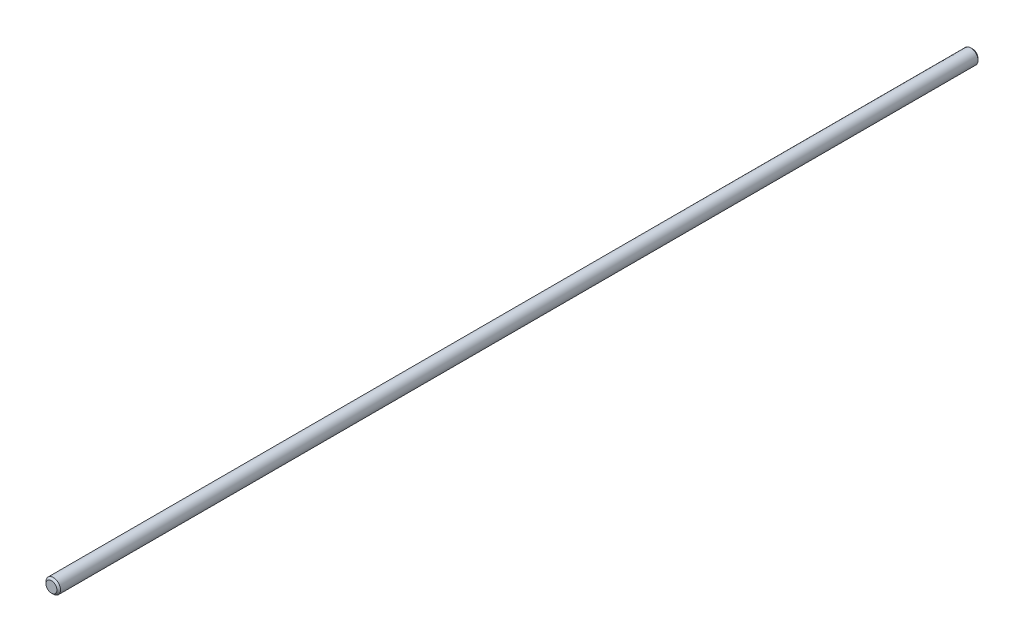
ISO-10303-21;
HEADER;
FILE_DESCRIPTION(('STEP AP214'),'2;1');
FILE_NAME('part.step','',(''),(''),'','','');
FILE_SCHEMA(('AUTOMOTIVE_DESIGN { 1 0 10303 214 1 1 1 1 }'));
ENDSEC;
DATA;
#1=APPLICATION_CONTEXT('core data for automotive mechanical design processes');
#2=APPLICATION_PROTOCOL_DEFINITION('international standard','automotive_design',2000,#1);
#3=PRODUCT_CONTEXT('',#1,'mechanical');
#4=PRODUCT('Part','Part','',(#3));
#5=PRODUCT_RELATED_PRODUCT_CATEGORY('part','',(#4));
#6=PRODUCT_DEFINITION_FORMATION('','',#4);
#7=PRODUCT_DEFINITION_CONTEXT('part definition',#1,'design');
#8=PRODUCT_DEFINITION('design','',#6,#7);
#9=PRODUCT_DEFINITION_SHAPE('','',#8);
#10=(LENGTH_UNIT() NAMED_UNIT(*) SI_UNIT(.MILLI.,.METRE.));
#11=(NAMED_UNIT(*) PLANE_ANGLE_UNIT() SI_UNIT($,.RADIAN.));
#12=(NAMED_UNIT(*) SI_UNIT($,.STERADIAN.) SOLID_ANGLE_UNIT());
#13=UNCERTAINTY_MEASURE_WITH_UNIT(LENGTH_MEASURE(1.E-05),#10,'distance_accuracy_value','');
#14=(GEOMETRIC_REPRESENTATION_CONTEXT(3) GLOBAL_UNCERTAINTY_ASSIGNED_CONTEXT((#13)) GLOBAL_UNIT_ASSIGNED_CONTEXT((#10,
#11,#12)) REPRESENTATION_CONTEXT('',''));
#15=CARTESIAN_POINT('',(0.,0.,0.));
#16=DIRECTION('',(0.,0.,1.));
#17=DIRECTION('',(1.,0.,0.));
#18=AXIS2_PLACEMENT_3D('',#15,#16,#17);
#19=CARTESIAN_POINT('',(0.,0.,507.));
#20=DIRECTION('',(0.,0.,-1.));
#21=DIRECTION('',(-1.,0.,0.));
#22=AXIS2_PLACEMENT_3D('',#19,#20,#21);
#23=CYLINDRICAL_SURFACE('',#22,4.);
#24=CARTESIAN_POINT('',(0.,0.,506.));
#25=DIRECTION('',(0.,0.,1.));
#26=DIRECTION('',(1.,0.,0.));
#27=AXIS2_PLACEMENT_3D('',#24,#25,#26);
#28=CIRCLE('',#27,4.);
#29=CARTESIAN_POINT('',(4.,0.,506.));
#30=VERTEX_POINT('',#29);
#31=EDGE_CURVE('E38',#30,#30,#28,.F.);
#32=ORIENTED_EDGE('',*,*,#31,.T.);
#33=EDGE_LOOP('',(#32));
#34=FACE_BOUND('',#33,.T.);
#35=CARTESIAN_POINT('',(0.,0.,0.99999999999989));
#36=DIRECTION('',(0.,0.,1.));
#37=DIRECTION('',(1.,0.,0.));
#38=AXIS2_PLACEMENT_3D('',#35,#36,#37);
#39=CIRCLE('',#38,4.);
#40=CARTESIAN_POINT('',(4.,0.,0.99999999999989));
#41=VERTEX_POINT('',#40);
#42=EDGE_CURVE('E42',#41,#41,#39,.T.);
#43=ORIENTED_EDGE('',*,*,#42,.T.);
#44=EDGE_LOOP('',(#43));
#45=FACE_BOUND('',#44,.T.);
#46=ADVANCED_FACE('F31',(#34,#45),#23,.T.);
#47=CARTESIAN_POINT('',(0.,0.,507.));
#48=DIRECTION('',(0.,0.,1.));
#49=DIRECTION('',(1.,0.,0.));
#50=AXIS2_PLACEMENT_3D('',#47,#48,#49);
#51=PLANE('',#50);
#52=CARTESIAN_POINT('',(0.,0.,507.));
#53=DIRECTION('',(0.,0.,1.));
#54=DIRECTION('',(1.,0.,0.));
#55=AXIS2_PLACEMENT_3D('',#52,#53,#54);
#56=CIRCLE('',#55,3.);
#57=CARTESIAN_POINT('',(3.,0.,507.));
#58=VERTEX_POINT('',#57);
#59=EDGE_CURVE('E46',#58,#58,#56,.T.);
#60=ORIENTED_EDGE('',*,*,#59,.T.);
#61=EDGE_LOOP('',(#60));
#62=FACE_BOUND('',#61,.T.);
#63=ADVANCED_FACE('F52',(#62),#51,.T.);
#64=CARTESIAN_POINT('',(0.,0.,0.));
#65=DIRECTION('',(0.,0.,1.));
#66=DIRECTION('',(1.,0.,0.));
#67=AXIS2_PLACEMENT_3D('',#64,#65,#66);
#68=PLANE('',#67);
#69=CARTESIAN_POINT('',(0.,0.,0.));
#70=DIRECTION('',(0.,0.,1.));
#71=DIRECTION('',(1.,0.,0.));
#72=AXIS2_PLACEMENT_3D('',#69,#70,#71);
#73=CIRCLE('',#72,3.00000000000011);
#74=CARTESIAN_POINT('',(3.00000000000011,0.,0.));
#75=VERTEX_POINT('',#74);
#76=EDGE_CURVE('E10',#75,#75,#73,.F.);
#77=ORIENTED_EDGE('',*,*,#76,.T.);
#78=EDGE_LOOP('',(#77));
#79=FACE_BOUND('',#78,.T.);
#80=ADVANCED_FACE('F56',(#79),#68,.F.);
#81=CARTESIAN_POINT('',(0.,0.,507.));
#82=DIRECTION('',(0.,0.,-1.));
#83=DIRECTION('',(-1.,0.,0.));
#84=AXIS2_PLACEMENT_3D('',#81,#82,#83);
#85=CONICAL_SURFACE('',#84,3.,0.785398163397502);
#86=ORIENTED_EDGE('',*,*,#31,.F.);
#87=EDGE_LOOP('',(#86));
#88=FACE_BOUND('',#87,.T.);
#89=ORIENTED_EDGE('',*,*,#59,.F.);
#90=EDGE_LOOP('',(#89));
#91=FACE_BOUND('',#90,.T.);
#92=ADVANCED_FACE('F54',(#88,#91),#85,.T.);
#93=CARTESIAN_POINT('',(0.,0.,0.99999999999989));
#94=DIRECTION('',(0.,0.,1.));
#95=DIRECTION('',(1.,0.,0.));
#96=AXIS2_PLACEMENT_3D('',#93,#94,#95);
#97=CONICAL_SURFACE('',#96,4.,0.785398163397447);
#98=ORIENTED_EDGE('',*,*,#76,.F.);
#99=EDGE_LOOP('',(#98));
#100=FACE_BOUND('',#99,.T.);
#101=ORIENTED_EDGE('',*,*,#42,.F.);
#102=EDGE_LOOP('',(#101));
#103=FACE_BOUND('',#102,.T.);
#104=ADVANCED_FACE('F33',(#100,#103),#97,.T.);
#105=CLOSED_SHELL('',(#46,#63,#80,#92,#104));
#106=MANIFOLD_SOLID_BREP('B2',#105);
#107=ADVANCED_BREP_SHAPE_REPRESENTATION('',(#18,#106),#14);
#108=SHAPE_DEFINITION_REPRESENTATION(#9,#107);
ENDSEC;
END-ISO-10303-21;
